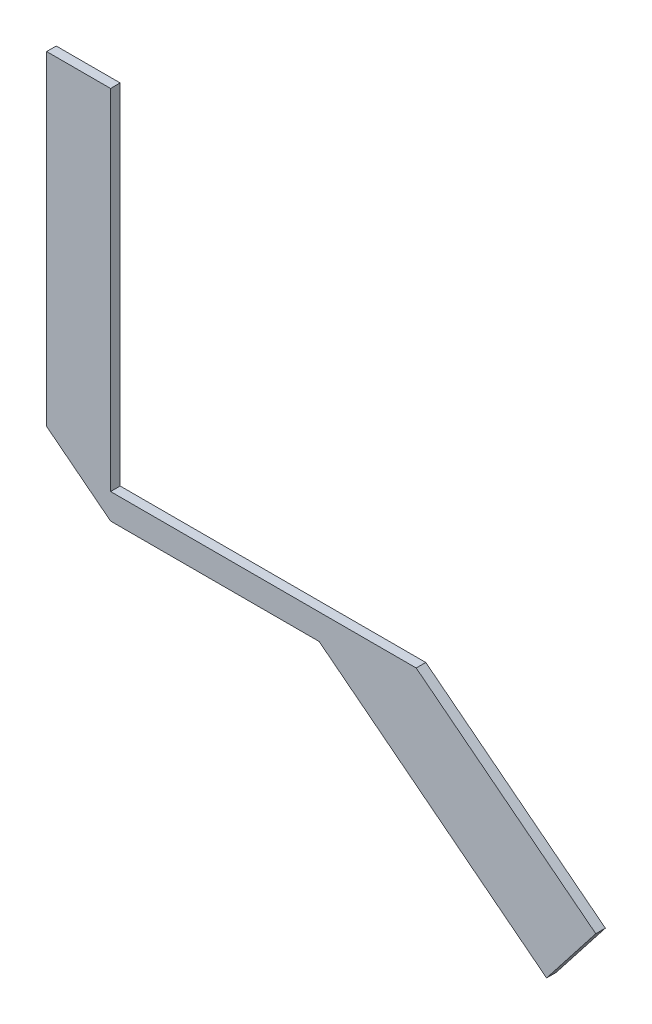
ISO-10303-21;
HEADER;
FILE_DESCRIPTION(('STEP AP214'),'2;1');
FILE_NAME('part.step','',(''),(''),'','','');
FILE_SCHEMA(('AUTOMOTIVE_DESIGN { 1 0 10303 214 1 1 1 1 }'));
ENDSEC;
DATA;
#1=APPLICATION_CONTEXT('core data for automotive mechanical design processes');
#2=APPLICATION_PROTOCOL_DEFINITION('international standard','automotive_design',2000,#1);
#3=PRODUCT_CONTEXT('',#1,'mechanical');
#4=PRODUCT('Part','Part','',(#3));
#5=PRODUCT_RELATED_PRODUCT_CATEGORY('part','',(#4));
#6=PRODUCT_DEFINITION_FORMATION('','',#4);
#7=PRODUCT_DEFINITION_CONTEXT('part definition',#1,'design');
#8=PRODUCT_DEFINITION('design','',#6,#7);
#9=PRODUCT_DEFINITION_SHAPE('','',#8);
#10=(LENGTH_UNIT() NAMED_UNIT(*) SI_UNIT(.MILLI.,.METRE.));
#11=(NAMED_UNIT(*) PLANE_ANGLE_UNIT() SI_UNIT($,.RADIAN.));
#12=(NAMED_UNIT(*) SI_UNIT($,.STERADIAN.) SOLID_ANGLE_UNIT());
#13=UNCERTAINTY_MEASURE_WITH_UNIT(LENGTH_MEASURE(1.E-05),#10,'distance_accuracy_value','');
#14=(GEOMETRIC_REPRESENTATION_CONTEXT(3) GLOBAL_UNCERTAINTY_ASSIGNED_CONTEXT((#13)) GLOBAL_UNIT_ASSIGNED_CONTEXT((#10,
#11,#12)) REPRESENTATION_CONTEXT('',''));
#15=CARTESIAN_POINT('',(0.,0.,0.));
#16=DIRECTION('',(0.,0.,1.));
#17=DIRECTION('',(1.,0.,0.));
#18=AXIS2_PLACEMENT_3D('',#15,#16,#17);
#19=CARTESIAN_POINT('',(-331.82666872898,452.478862829639,-4.99999999999854));
#20=DIRECTION('',(0.,1.,0.));
#21=DIRECTION('',(0.,0.,1.));
#22=AXIS2_PLACEMENT_3D('',#19,#20,#21);
#23=PLANE('',#22);
#24=DIRECTION('',(-1.,0.,0.));
#25=VECTOR('',#24,1.);
#26=CARTESIAN_POINT('',(-331.82666872898,452.478862829639,-1.99999999999854));
#27=LINE('',#26,#25);
#28=CARTESIAN_POINT('',(-331.82666872898,452.478862829639,-1.99999999999854));
#29=VERTEX_POINT('',#28);
#30=CARTESIAN_POINT('',(-427.432442284161,452.478862829639,-1.99999999999854));
#31=VERTEX_POINT('',#30);
#32=EDGE_CURVE('E136',#29,#31,#27,.T.);
#33=ORIENTED_EDGE('',*,*,#32,.F.);
#34=DIRECTION('',(0.,0.,1.));
#35=VECTOR('',#34,1.);
#36=CARTESIAN_POINT('',(-331.82666872898,452.478862829639,-4.99999999999854));
#37=LINE('',#36,#35);
#38=CARTESIAN_POINT('',(-331.82666872898,452.478862829639,-4.99999999999854));
#39=VERTEX_POINT('',#38);
#40=EDGE_CURVE('E11',#39,#29,#37,.T.);
#41=ORIENTED_EDGE('',*,*,#40,.F.);
#42=DIRECTION('',(-1.,0.,0.));
#43=VECTOR('',#42,1.);
#44=CARTESIAN_POINT('',(-331.82666872898,452.478862829639,-4.99999999999854));
#45=LINE('',#44,#43);
#46=CARTESIAN_POINT('',(-427.432442284161,452.478862829639,-4.99999999999854));
#47=VERTEX_POINT('',#46);
#48=EDGE_CURVE('E159',#39,#47,#45,.T.);
#49=ORIENTED_EDGE('',*,*,#48,.T.);
#50=DIRECTION('',(0.,0.,1.));
#51=VECTOR('',#50,1.);
#52=CARTESIAN_POINT('',(-427.432442284161,452.478862829639,-4.99999999999854));
#53=LINE('',#52,#51);
#54=EDGE_CURVE('E36',#47,#31,#53,.T.);
#55=ORIENTED_EDGE('',*,*,#54,.T.);
#56=EDGE_LOOP('',(#33,#41,#49,#55));
#57=FACE_BOUND('',#56,.T.);
#58=ADVANCED_FACE('F33',(#57),#23,.T.);
#59=CARTESIAN_POINT('',(-331.82666872898,452.478862829639,-4.99999999999854));
#60=DIRECTION('',(0.615661475325659,0.788010753606722,0.));
#61=DIRECTION('',(-0.788010753606722,0.615661475325659,0.));
#62=AXIS2_PLACEMENT_3D('',#59,#60,#61);
#63=PLANE('',#62);
#64=DIRECTION('',(-0.788010753606722,0.615661475325659,0.));
#65=VECTOR('',#64,1.);
#66=CARTESIAN_POINT('',(-331.82666872898,452.478862829639,-1.99999999999854));
#67=LINE('',#66,#65);
#68=CARTESIAN_POINT('',(-275.64720914749,408.586658553705,-1.99999999999854));
#69=VERTEX_POINT('',#68);
#70=EDGE_CURVE('E157',#69,#29,#67,.T.);
#71=ORIENTED_EDGE('',*,*,#70,.F.);
#72=DIRECTION('',(0.,0.,1.));
#73=VECTOR('',#72,1.);
#74=CARTESIAN_POINT('',(-275.64720914749,408.586658553705,-4.99999999999854));
#75=LINE('',#74,#73);
#76=CARTESIAN_POINT('',(-275.64720914749,408.586658553705,-4.99999999999854));
#77=VERTEX_POINT('',#76);
#78=EDGE_CURVE('E42',#77,#69,#75,.T.);
#79=ORIENTED_EDGE('',*,*,#78,.F.);
#80=DIRECTION('',(-0.788010753606722,0.615661475325659,0.));
#81=VECTOR('',#80,1.);
#82=CARTESIAN_POINT('',(-331.82666872898,452.478862829639,-4.99999999999854));
#83=LINE('',#82,#81);
#84=EDGE_CURVE('E126',#77,#39,#83,.T.);
#85=ORIENTED_EDGE('',*,*,#84,.T.);
#86=ORIENTED_EDGE('',*,*,#40,.T.);
#87=EDGE_LOOP('',(#71,#79,#85,#86));
#88=FACE_BOUND('',#87,.T.);
#89=ADVANCED_FACE('F173',(#88),#63,.T.);
#90=CARTESIAN_POINT('',(-275.64720914749,408.586658553705,-4.99999999999854));
#91=DIRECTION('',(0.788010753606721,-0.615661475325659,0.));
#92=DIRECTION('',(0.615661475325659,0.788010753606721,0.));
#93=AXIS2_PLACEMENT_3D('',#90,#91,#92);
#94=PLANE('',#93);
#95=DIRECTION('',(0.615661475325659,0.788010753606721,0.));
#96=VECTOR('',#95,1.);
#97=CARTESIAN_POINT('',(-275.64720914749,408.586658553705,-1.99999999999854));
#98=LINE('',#97,#96);
#99=CARTESIAN_POINT('',(-291.038746030631,388.886389713537,-1.99999999999854));
#100=VERTEX_POINT('',#99);
#101=EDGE_CURVE('E113',#100,#69,#98,.T.);
#102=ORIENTED_EDGE('',*,*,#101,.F.);
#103=DIRECTION('',(0.,0.,1.));
#104=VECTOR('',#103,1.);
#105=CARTESIAN_POINT('',(-291.038746030631,388.886389713537,-4.99999999999854));
#106=LINE('',#105,#104);
#107=CARTESIAN_POINT('',(-291.038746030631,388.886389713537,-4.99999999999854));
#108=VERTEX_POINT('',#107);
#109=EDGE_CURVE('E108',#108,#100,#106,.T.);
#110=ORIENTED_EDGE('',*,*,#109,.F.);
#111=DIRECTION('',(0.615661475325659,0.788010753606721,0.));
#112=VECTOR('',#111,1.);
#113=CARTESIAN_POINT('',(-275.64720914749,408.586658553705,-4.99999999999854));
#114=LINE('',#113,#112);
#115=EDGE_CURVE('E111',#108,#77,#114,.T.);
#116=ORIENTED_EDGE('',*,*,#115,.T.);
#117=ORIENTED_EDGE('',*,*,#78,.T.);
#118=EDGE_LOOP('',(#102,#110,#116,#117));
#119=FACE_BOUND('',#118,.T.);
#120=ADVANCED_FACE('F110',(#119),#94,.T.);
#121=CARTESIAN_POINT('',(-291.038746030631,388.886389713537,-4.99999999999854));
#122=DIRECTION('',(-0.615661475325659,-0.788010753606721,0.));
#123=DIRECTION('',(0.788010753606721,-0.615661475325659,0.));
#124=AXIS2_PLACEMENT_3D('',#121,#122,#123);
#125=PLANE('',#124);
#126=DIRECTION('',(0.788010753606721,-0.615661475325659,0.));
#127=VECTOR('',#126,1.);
#128=CARTESIAN_POINT('',(-291.038746030631,388.886389713537,-1.99999999999854));
#129=LINE('',#128,#127);
#130=CARTESIAN_POINT('',(-362.193866808504,444.478862829639,-1.99999999999854));
#131=VERTEX_POINT('',#130);
#132=EDGE_CURVE('E154',#131,#100,#129,.T.);
#133=ORIENTED_EDGE('',*,*,#132,.F.);
#134=DIRECTION('',(0.,0.,1.));
#135=VECTOR('',#134,1.);
#136=CARTESIAN_POINT('',(-362.193866808504,444.478862829639,-4.99999999999854));
#137=LINE('',#136,#135);
#138=CARTESIAN_POINT('',(-362.193866808504,444.478862829639,-4.99999999999854));
#139=VERTEX_POINT('',#138);
#140=EDGE_CURVE('E118',#139,#131,#137,.T.);
#141=ORIENTED_EDGE('',*,*,#140,.F.);
#142=DIRECTION('',(0.788010753606721,-0.615661475325659,0.));
#143=VECTOR('',#142,1.);
#144=CARTESIAN_POINT('',(-291.038746030631,388.886389713537,-4.99999999999854));
#145=LINE('',#144,#143);
#146=EDGE_CURVE('E124',#139,#108,#145,.T.);
#147=ORIENTED_EDGE('',*,*,#146,.T.);
#148=ORIENTED_EDGE('',*,*,#109,.T.);
#149=EDGE_LOOP('',(#133,#141,#147,#148));
#150=FACE_BOUND('',#149,.T.);
#151=ADVANCED_FACE('F128',(#150),#125,.T.);
#152=CARTESIAN_POINT('',(-362.193866808504,444.478862829639,-4.99999999999854));
#153=DIRECTION('',(0.,-1.,0.));
#154=DIRECTION('',(0.,0.,-1.));
#155=AXIS2_PLACEMENT_3D('',#152,#153,#154);
#156=PLANE('',#155);
#157=DIRECTION('',(1.,0.,0.));
#158=VECTOR('',#157,1.);
#159=CARTESIAN_POINT('',(-362.193866808504,444.478862829639,-1.99999999999854));
#160=LINE('',#159,#158);
#161=CARTESIAN_POINT('',(-427.432442284161,444.478862829639,-1.99999999999854));
#162=VERTEX_POINT('',#161);
#163=EDGE_CURVE('E151',#162,#131,#160,.T.);
#164=ORIENTED_EDGE('',*,*,#163,.F.);
#165=DIRECTION('',(0.,0.,1.));
#166=VECTOR('',#165,1.);
#167=CARTESIAN_POINT('',(-427.432442284161,444.478862829639,-4.99999999999854));
#168=LINE('',#167,#166);
#169=CARTESIAN_POINT('',(-427.432442284161,444.478862829639,-4.99999999999854));
#170=VERTEX_POINT('',#169);
#171=EDGE_CURVE('E163',#170,#162,#168,.T.);
#172=ORIENTED_EDGE('',*,*,#171,.F.);
#173=DIRECTION('',(1.,0.,0.));
#174=VECTOR('',#173,1.);
#175=CARTESIAN_POINT('',(-362.193866808504,444.478862829639,-4.99999999999854));
#176=LINE('',#175,#174);
#177=EDGE_CURVE('E129',#170,#139,#176,.T.);
#178=ORIENTED_EDGE('',*,*,#177,.T.);
#179=ORIENTED_EDGE('',*,*,#140,.T.);
#180=EDGE_LOOP('',(#164,#172,#178,#179));
#181=FACE_BOUND('',#180,.T.);
#182=ADVANCED_FACE('F186',(#181),#156,.T.);
#183=CARTESIAN_POINT('',(-427.432442284161,444.478862829639,-4.99999999999854));
#184=DIRECTION('',(-0.615661475325659,-0.788010753606721,0.));
#185=DIRECTION('',(0.788010753606721,-0.615661475325659,0.));
#186=AXIS2_PLACEMENT_3D('',#183,#184,#185);
#187=PLANE('',#186);
#188=DIRECTION('',(0.788010753606721,-0.615661475325659,0.));
#189=VECTOR('',#188,1.);
#190=CARTESIAN_POINT('',(-427.432442284161,444.478862829639,-1.99999999999854));
#191=LINE('',#190,#189);
#192=CARTESIAN_POINT('',(-447.432442284161,460.104575359773,-1.99999999999854));
#193=VERTEX_POINT('',#192);
#194=EDGE_CURVE('E148',#193,#162,#191,.T.);
#195=ORIENTED_EDGE('',*,*,#194,.F.);
#196=DIRECTION('',(0.,0.,1.));
#197=VECTOR('',#196,1.);
#198=CARTESIAN_POINT('',(-447.432442284161,460.104575359773,-4.99999999999854));
#199=LINE('',#198,#197);
#200=CARTESIAN_POINT('',(-447.432442284161,460.104575359773,-4.99999999999854));
#201=VERTEX_POINT('',#200);
#202=EDGE_CURVE('E165',#201,#193,#199,.T.);
#203=ORIENTED_EDGE('',*,*,#202,.F.);
#204=DIRECTION('',(0.788010753606721,-0.615661475325659,0.));
#205=VECTOR('',#204,1.);
#206=CARTESIAN_POINT('',(-427.432442284161,444.478862829639,-4.99999999999854));
#207=LINE('',#206,#205);
#208=EDGE_CURVE('E131',#201,#170,#207,.T.);
#209=ORIENTED_EDGE('',*,*,#208,.T.);
#210=ORIENTED_EDGE('',*,*,#171,.T.);
#211=EDGE_LOOP('',(#195,#203,#209,#210));
#212=FACE_BOUND('',#211,.T.);
#213=ADVANCED_FACE('F189',(#212),#187,.T.);
#214=CARTESIAN_POINT('',(-447.432442284162,561.679955314006,-4.99999999999854));
#215=DIRECTION('',(-1.,0.,0.));
#216=DIRECTION('',(0.,-1.,0.));
#217=AXIS2_PLACEMENT_3D('',#214,#215,#216);
#218=PLANE('',#217);
#219=DIRECTION('',(0.,-1.,0.));
#220=VECTOR('',#219,1.);
#221=CARTESIAN_POINT('',(-447.432442284162,561.679955314006,-1.99999999999854));
#222=LINE('',#221,#220);
#223=CARTESIAN_POINT('',(-447.432442284162,561.679955314006,-1.99999999999854));
#224=VERTEX_POINT('',#223);
#225=EDGE_CURVE('E145',#224,#193,#222,.T.);
#226=ORIENTED_EDGE('',*,*,#225,.F.);
#227=DIRECTION('',(0.,0.,1.));
#228=VECTOR('',#227,1.);
#229=CARTESIAN_POINT('',(-447.432442284162,561.679955314006,-4.99999999999854));
#230=LINE('',#229,#228);
#231=CARTESIAN_POINT('',(-447.432442284162,561.679955314006,-4.99999999999854));
#232=VERTEX_POINT('',#231);
#233=EDGE_CURVE('E167',#232,#224,#230,.T.);
#234=ORIENTED_EDGE('',*,*,#233,.F.);
#235=DIRECTION('',(0.,-1.,0.));
#236=VECTOR('',#235,1.);
#237=CARTESIAN_POINT('',(-447.432442284162,561.679955314006,-4.99999999999854));
#238=LINE('',#237,#236);
#239=EDGE_CURVE('E274',#232,#201,#238,.T.);
#240=ORIENTED_EDGE('',*,*,#239,.T.);
#241=ORIENTED_EDGE('',*,*,#202,.T.);
#242=EDGE_LOOP('',(#226,#234,#240,#241));
#243=FACE_BOUND('',#242,.T.);
#244=ADVANCED_FACE('F193',(#243),#218,.T.);
#245=CARTESIAN_POINT('',(-427.432442284161,561.679955314006,-4.99999999999854));
#246=DIRECTION('',(0.,1.,0.));
#247=DIRECTION('',(0.,0.,1.));
#248=AXIS2_PLACEMENT_3D('',#245,#246,#247);
#249=PLANE('',#248);
#250=DIRECTION('',(-1.,0.,0.));
#251=VECTOR('',#250,1.);
#252=CARTESIAN_POINT('',(-427.432442284161,561.679955314006,-1.99999999999854));
#253=LINE('',#252,#251);
#254=CARTESIAN_POINT('',(-427.432442284161,561.679955314006,-1.99999999999854));
#255=VERTEX_POINT('',#254);
#256=EDGE_CURVE('E142',#255,#224,#253,.T.);
#257=ORIENTED_EDGE('',*,*,#256,.F.);
#258=DIRECTION('',(0.,0.,1.));
#259=VECTOR('',#258,1.);
#260=CARTESIAN_POINT('',(-427.432442284161,561.679955314006,-4.99999999999854));
#261=LINE('',#260,#259);
#262=CARTESIAN_POINT('',(-427.432442284161,561.679955314006,-4.99999999999854));
#263=VERTEX_POINT('',#262);
#264=EDGE_CURVE('E168',#263,#255,#261,.T.);
#265=ORIENTED_EDGE('',*,*,#264,.F.);
#266=DIRECTION('',(-1.,0.,0.));
#267=VECTOR('',#266,1.);
#268=CARTESIAN_POINT('',(-427.432442284161,561.679955314006,-4.99999999999854));
#269=LINE('',#268,#267);
#270=EDGE_CURVE('E278',#263,#232,#269,.T.);
#271=ORIENTED_EDGE('',*,*,#270,.T.);
#272=ORIENTED_EDGE('',*,*,#233,.T.);
#273=EDGE_LOOP('',(#257,#265,#271,#272));
#274=FACE_BOUND('',#273,.T.);
#275=ADVANCED_FACE('F197',(#274),#249,.T.);
#276=CARTESIAN_POINT('',(-427.432442284161,452.478862829639,-4.99999999999854));
#277=DIRECTION('',(1.,0.,0.));
#278=DIRECTION('',(0.,0.,-1.));
#279=AXIS2_PLACEMENT_3D('',#276,#277,#278);
#280=PLANE('',#279);
#281=DIRECTION('',(0.,1.,0.));
#282=VECTOR('',#281,1.);
#283=CARTESIAN_POINT('',(-427.432442284161,452.478862829639,-1.99999999999854));
#284=LINE('',#283,#282);
#285=EDGE_CURVE('E139',#31,#255,#284,.T.);
#286=ORIENTED_EDGE('',*,*,#285,.F.);
#287=ORIENTED_EDGE('',*,*,#54,.F.);
#288=DIRECTION('',(0.,1.,0.));
#289=VECTOR('',#288,1.);
#290=CARTESIAN_POINT('',(-427.432442284161,452.478862829639,-4.99999999999854));
#291=LINE('',#290,#289);
#292=EDGE_CURVE('E282',#47,#263,#291,.T.);
#293=ORIENTED_EDGE('',*,*,#292,.T.);
#294=ORIENTED_EDGE('',*,*,#264,.T.);
#295=EDGE_LOOP('',(#286,#287,#293,#294));
#296=FACE_BOUND('',#295,.T.);
#297=ADVANCED_FACE('F170',(#296),#280,.T.);
#298=CARTESIAN_POINT('',(0.,0.,-4.99999999999854));
#299=DIRECTION('',(0.,0.,-1.));
#300=DIRECTION('',(-1.,0.,0.));
#301=AXIS2_PLACEMENT_3D('',#298,#299,#300);
#302=PLANE('',#301);
#303=ORIENTED_EDGE('',*,*,#48,.F.);
#304=ORIENTED_EDGE('',*,*,#84,.F.);
#305=ORIENTED_EDGE('',*,*,#115,.F.);
#306=ORIENTED_EDGE('',*,*,#146,.F.);
#307=ORIENTED_EDGE('',*,*,#177,.F.);
#308=ORIENTED_EDGE('',*,*,#208,.F.);
#309=ORIENTED_EDGE('',*,*,#239,.F.);
#310=ORIENTED_EDGE('',*,*,#270,.F.);
#311=ORIENTED_EDGE('',*,*,#292,.F.);
#312=EDGE_LOOP('',(#303,#304,#305,#306,#307,#308,#309,#310,#311));
#313=FACE_BOUND('',#312,.T.);
#314=ADVANCED_FACE('F122',(#313),#302,.T.);
#315=CARTESIAN_POINT('',(0.,0.,-1.99999999999854));
#316=DIRECTION('',(0.,0.,-1.));
#317=DIRECTION('',(-1.,0.,0.));
#318=AXIS2_PLACEMENT_3D('',#315,#316,#317);
#319=PLANE('',#318);
#320=ORIENTED_EDGE('',*,*,#32,.T.);
#321=ORIENTED_EDGE('',*,*,#285,.T.);
#322=ORIENTED_EDGE('',*,*,#256,.T.);
#323=ORIENTED_EDGE('',*,*,#225,.T.);
#324=ORIENTED_EDGE('',*,*,#194,.T.);
#325=ORIENTED_EDGE('',*,*,#163,.T.);
#326=ORIENTED_EDGE('',*,*,#132,.T.);
#327=ORIENTED_EDGE('',*,*,#101,.T.);
#328=ORIENTED_EDGE('',*,*,#70,.T.);
#329=EDGE_LOOP('',(#320,#321,#322,#323,#324,#325,#326,#327,#328));
#330=FACE_BOUND('',#329,.T.);
#331=ADVANCED_FACE('F172',(#330),#319,.F.);
#332=CLOSED_SHELL('',(#58,#89,#120,#151,#182,#213,#244,#275,#297,#314,#331));
#333=MANIFOLD_SOLID_BREP('B2',#332);
#334=ADVANCED_BREP_SHAPE_REPRESENTATION('',(#18,#333),#14);
#335=SHAPE_DEFINITION_REPRESENTATION(#9,#334);
ENDSEC;
END-ISO-10303-21;
